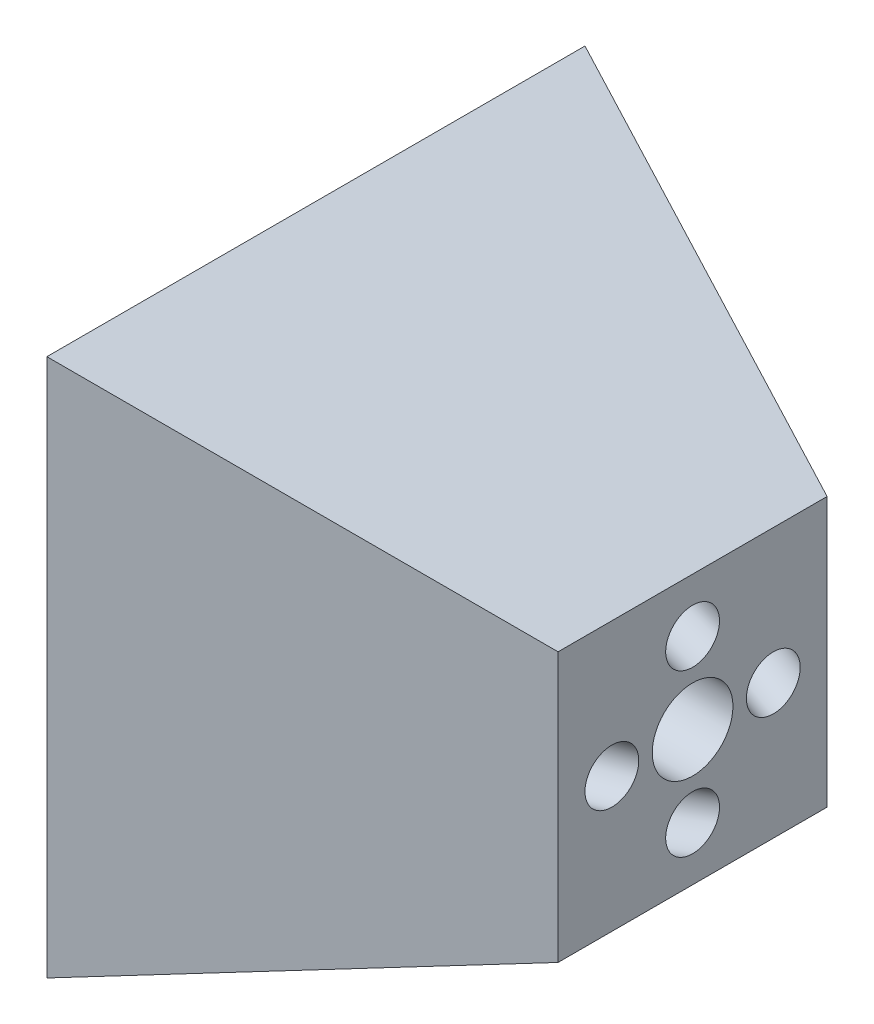
ISO-10303-21;
HEADER;
FILE_DESCRIPTION(('STEP AP214'),'2;1');
FILE_NAME('part.step','',(''),(''),'','','');
FILE_SCHEMA(('AUTOMOTIVE_DESIGN { 1 0 10303 214 1 1 1 1 }'));
ENDSEC;
DATA;
#1=APPLICATION_CONTEXT('core data for automotive mechanical design processes');
#2=APPLICATION_PROTOCOL_DEFINITION('international standard','automotive_design',2000,#1);
#3=PRODUCT_CONTEXT('',#1,'mechanical');
#4=PRODUCT('Part','Part','',(#3));
#5=PRODUCT_RELATED_PRODUCT_CATEGORY('part','',(#4));
#6=PRODUCT_DEFINITION_FORMATION('','',#4);
#7=PRODUCT_DEFINITION_CONTEXT('part definition',#1,'design');
#8=PRODUCT_DEFINITION('design','',#6,#7);
#9=PRODUCT_DEFINITION_SHAPE('','',#8);
#10=(LENGTH_UNIT() NAMED_UNIT(*) SI_UNIT(.MILLI.,.METRE.));
#11=(NAMED_UNIT(*) PLANE_ANGLE_UNIT() SI_UNIT($,.RADIAN.));
#12=(NAMED_UNIT(*) SI_UNIT($,.STERADIAN.) SOLID_ANGLE_UNIT());
#13=UNCERTAINTY_MEASURE_WITH_UNIT(LENGTH_MEASURE(1.E-05),#10,'distance_accuracy_value','');
#14=(GEOMETRIC_REPRESENTATION_CONTEXT(3) GLOBAL_UNCERTAINTY_ASSIGNED_CONTEXT((#13)) GLOBAL_UNIT_ASSIGNED_CONTEXT((#10,
#11,#12)) REPRESENTATION_CONTEXT('',''));
#15=CARTESIAN_POINT('',(0.,0.,0.));
#16=DIRECTION('',(0.,0.,1.));
#17=DIRECTION('',(1.,0.,0.));
#18=AXIS2_PLACEMENT_3D('',#15,#16,#17);
#19=CARTESIAN_POINT('',(-70.,0.,0.));
#20=DIRECTION('',(-1.,0.,0.));
#21=DIRECTION('',(0.,0.,1.));
#22=AXIS2_PLACEMENT_3D('',#19,#20,#21);
#23=PLANE('',#22);
#24=CARTESIAN_POINT('',(-70.,0.,0.));
#25=DIRECTION('',(-1.,0.,0.));
#26=DIRECTION('',(0.,0.,1.));
#27=AXIS2_PLACEMENT_3D('',#24,#25,#26);
#28=CIRCLE('',#27,7.5);
#29=CARTESIAN_POINT('',(-70.,0.,7.5));
#30=VERTEX_POINT('',#29);
#31=EDGE_CURVE('E257',#30,#30,#28,.T.);
#32=ORIENTED_EDGE('',*,*,#31,.F.);
#33=EDGE_LOOP('',(#32));
#34=FACE_BOUND('',#33,.T.);
#35=CARTESIAN_POINT('',(-70.,-40.,-5.));
#36=CARTESIAN_POINT('',(-70.,-40.1385285597722,-5.00000032981713));
#37=CARTESIAN_POINT('',(-70.,-40.2770598404374,-4.99423959397132));
#38=CARTESIAN_POINT('',(-70.,-40.5532169653213,-4.9712328197264));
#39=CARTESIAN_POINT('',(-70.,-40.690842445484,-4.95398241790151));
#40=CARTESIAN_POINT('',(-70.,-40.9641349848805,-4.9081192702556));
#41=CARTESIAN_POINT('',(-70.,-41.099802749291,-4.87951072719971));
#42=CARTESIAN_POINT('',(-70.,-41.368342982769,-4.81111653050569));
#43=CARTESIAN_POINT('',(-70.,-41.5012144289693,-4.77132686075552));
#44=CARTESIAN_POINT('',(-70.,-41.7631465157636,-4.68086588087655));
#45=CARTESIAN_POINT('',(-70.,-41.8922085079045,-4.63019848412395));
#46=CARTESIAN_POINT('',(-70.,-42.1457259013435,-4.51830334453991));
#47=CARTESIAN_POINT('',(-70.,-42.2701796325698,-4.45707181780892));
#48=CARTESIAN_POINT('',(-70.,-42.513527926577,-4.32450788011614));
#49=CARTESIAN_POINT('',(-70.,-42.6324244678463,-4.25317910101307));
#50=CARTESIAN_POINT('',(-70.,-42.8639267217283,-4.10086923517197));
#51=CARTESIAN_POINT('',(-70.,-42.9765301613516,-4.01988469356487));
#52=CARTESIAN_POINT('',(-70.,-43.1945828135308,-3.84887408108859));
#53=CARTESIAN_POINT('',(-70.,-43.3000345781974,-3.75885126432174));
#54=CARTESIAN_POINT('',(-70.,-43.5031365499259,-3.57032758490311));
#55=CARTESIAN_POINT('',(-70.,-43.6007839435785,-3.47182369123995));
#56=CARTESIAN_POINT('',(-70.,-43.7875267670873,-3.26708310772285));
#57=CARTESIAN_POINT('',(-70.,-43.8766252524076,-3.16084920470053));
#58=CARTESIAN_POINT('',(-70.,-44.0457251141884,-2.94131145127637));
#59=CARTESIAN_POINT('',(-70.,-44.1257232143997,-2.82800507729169));
#60=CARTESIAN_POINT('',(-70.,-44.2760055881049,-2.5951815442083));
#61=CARTESIAN_POINT('',(-70.,-44.3462933361537,-2.47566662782154));
#62=CARTESIAN_POINT('',(-70.,-44.4767270860926,-2.23116995645625));
#63=CARTESIAN_POINT('',(-70.,-44.5368694392566,-2.10618625492972));
#64=CARTESIAN_POINT('',(-70.,-44.6465463639701,-1.85170133664759));
#65=CARTESIAN_POINT('',(-70.,-44.6960847333377,-1.72220175664351));
#66=CARTESIAN_POINT('',(-70.,-44.7842548584076,-1.45948981041094));
#67=CARTESIAN_POINT('',(-70.,-44.8228826935603,-1.32627612841536));
#68=CARTESIAN_POINT('',(-70.,-44.8889290301765,-1.05714851815583));
#69=CARTESIAN_POINT('',(-70.,-44.9163515480349,-0.921235575754498));
#70=CARTESIAN_POINT('',(-70.,-44.9598265716953,-0.647555599702648));
#71=CARTESIAN_POINT('',(-70.,-44.9758749934918,-0.509787918160143));
#72=CARTESIAN_POINT('',(-70.,-44.9964676936532,-0.233435695490774));
#73=CARTESIAN_POINT('',(-70.,-45.0010160970825,-0.0948514651446628));
#74=CARTESIAN_POINT('',(-70.,-44.9986021457828,0.182230069313578));
#75=CARTESIAN_POINT('',(-70.,-44.9916356594831,0.32072732438062));
#76=CARTESIAN_POINT('',(-70.,-44.953482728418,0.734546474752408));
#77=CARTESIAN_POINT('',(-70.,-44.9050643005001,1.00848754755587));
#78=CARTESIAN_POINT('',(-70.,-44.7635758305878,1.5444319606773));
#79=CARTESIAN_POINT('',(-70.,-44.6705057885935,1.80643530099527));
#80=CARTESIAN_POINT('',(-70.,-44.4422819141459,2.31146468380315));
#81=CARTESIAN_POINT('',(-70.,-44.3071280816925,2.55449072629305));
#82=CARTESIAN_POINT('',(-70.,-43.9984641314033,3.0148124607998));
#83=CARTESIAN_POINT('',(-70.,-43.8249540135675,3.23210815281665));
#84=CARTESIAN_POINT('',(-70.,-43.4443631964797,3.63498929076985));
#85=CARTESIAN_POINT('',(-70.,-43.2372824972277,3.8205747367062));
#86=CARTESIAN_POINT('',(-70.,-42.7952620683577,4.15491308939109));
#87=CARTESIAN_POINT('',(-70.,-42.5603223387398,4.30366599613963));
#88=CARTESIAN_POINT('',(-70.,-42.0690638102171,4.56023742638518));
#89=CARTESIAN_POINT('',(-70.,-41.8127450113124,4.6680559498822));
#90=CARTESIAN_POINT('',(-70.,-41.285797963667,4.83978457424346));
#91=CARTESIAN_POINT('',(-70.,-41.0151697149264,4.90369467510771));
#92=CARTESIAN_POINT('',(-70.,-40.4670680625664,4.9858437959724));
#93=CARTESIAN_POINT('',(-70.,-40.189594658947,5.00408281597285));
#94=CARTESIAN_POINT('',(-70.,-39.6354557900676,4.99438669963854));
#95=CARTESIAN_POINT('',(-70.,-39.3587903248075,4.96645156330379));
#96=CARTESIAN_POINT('',(-70.,-38.8138981419513,4.8651776282638));
#97=CARTESIAN_POINT('',(-70.,-38.5456714243551,4.79183882955856));
#98=CARTESIAN_POINT('',(-70.,-38.025054793982,4.60178035212));
#99=CARTESIAN_POINT('',(-70.,-37.7726648812049,4.48506067338669));
#100=CARTESIAN_POINT('',(-70.,-37.2906831170471,4.21145972350985));
#101=CARTESIAN_POINT('',(-70.,-37.0610912656662,4.05457845236632));
#102=CARTESIAN_POINT('',(-70.,-36.63103807938,3.70498131609816));
#103=CARTESIAN_POINT('',(-70.,-36.4305767444746,3.51226545097352));
#104=CARTESIAN_POINT('',(-70.,-36.0643135870092,3.09631449206595));
#105=CARTESIAN_POINT('',(-70.,-35.8985117644491,2.87307939828303));
#106=CARTESIAN_POINT('',(-70.,-35.6061406711294,2.40224710911695));
#107=CARTESIAN_POINT('',(-70.,-35.4795714003697,2.15464991373378));
#108=CARTESIAN_POINT('',(-70.,-35.2691563630127,1.64192248831375));
#109=CARTESIAN_POINT('',(-70.,-35.1853105964155,1.37679225827689));
#110=CARTESIAN_POINT('',(-70.,-35.0626551475919,0.836311415287904));
#111=CARTESIAN_POINT('',(-70.,-35.0238454653656,0.560960802335789));
#112=CARTESIAN_POINT('',(-70.,-34.9923326086876,0.00763373772180405));
#113=CARTESIAN_POINT('',(-70.,-34.9996294342358,-0.270342713940066));
#114=CARTESIAN_POINT('',(-70.,-35.0601283380219,-0.821254489156064));
#115=CARTESIAN_POINT('',(-70.,-35.1133304162598,-1.09418981271019));
#116=CARTESIAN_POINT('',(-70.,-35.264172435097,-1.62749140013501));
#117=CARTESIAN_POINT('',(-70.,-35.3618123756963,-1.88785766400569));
#118=CARTESIAN_POINT('',(-70.,-35.5988370948303,-2.38883989431061));
#119=CARTESIAN_POINT('',(-70.,-35.7382218733651,-2.62945586074485));
#120=CARTESIAN_POINT('',(-70.,-36.0548917806495,-3.08430091602455));
#121=CARTESIAN_POINT('',(-70.,-36.2321769093991,-3.29853000487002));
#122=CARTESIAN_POINT('',(-70.,-36.6197579996372,-3.69469281836003));
#123=CARTESIAN_POINT('',(-70.,-36.8300539611259,-3.87662654300457));
#124=CARTESIAN_POINT('',(-70.,-37.2778555462234,-4.20317974343662));
#125=CARTESIAN_POINT('',(-70.,-37.5153611698324,-4.34779921922413));
#126=CARTESIAN_POINT('',(-70.,-38.0110347939087,-4.59573849952944));
#127=CARTESIAN_POINT('',(-70.,-38.2692027943761,-4.69905830404724));
#128=CARTESIAN_POINT('',(-70.,-38.7686106260893,-4.85219658129331));
#129=CARTESIAN_POINT('',(-70.,-39.0083845521352,-4.90680016248248));
#130=CARTESIAN_POINT('',(-70.,-39.3743108057609,-4.96227601702033));
#131=CARTESIAN_POINT('',(-70.,-39.4985855292943,-4.97636627846384));
#132=CARTESIAN_POINT('',(-70.,-39.7485699939562,-4.99525472988085));
#133=CARTESIAN_POINT('',(-70.,-39.8742838765479,-4.99999970068749));
#134=CARTESIAN_POINT('',(-70.,-40.,-5.));
#135=B_SPLINE_CURVE_WITH_KNOTS('',3,(#35,#36,#37,#38,#39,#40,#41,#42,#43,#44,#45,#46,#47,#48,
#49,#50,#51,#52,#53,#54,#55,#56,#57,#58,#59,#60,#61,#62,#63,#64,#65,#66,#67,#68,#69,#70,#71,#72,
#73,#74,#75,#76,#77,#78,#79,#80,#81,#82,#83,#84,#85,#86,#87,#88,#89,#90,#91,#92,#93,#94,#95,#96,
#97,#98,#99,#100,#101,#102,#103,#104,#105,#106,#107,#108,#109,#110,#111,#112,#113,#114,#115,
#116,#117,#118,#119,#120,#121,#122,#123,#124,#125,#126,#127,#128,#129,#130,#131,#132,#133,#134),
.UNSPECIFIED.,.T.,.F.,(4,2,2,2,2,2,2,2,2,2,2,2,2,2,2,2,2,2,2,2,2,2,2,2,2,2,2,2,2,2,2,2,2,2,2,2,
2,2,2,2,2,2,2,2,2,2,2,2,2,4),(0.,0.415470913561701,0.831099700376821,1.24657483840775,
1.66219940075635,2.07767468763347,2.49329910113597,2.90877439766643,3.32439880151561,
3.73987409870049,4.15549850189525,4.57097379912333,4.98659820227489,5.40207349950571,
5.81769790265452,6.23317319988551,6.64879760303415,7.06427290026514,7.47989730341377,
7.89537260064476,8.31099700379339,9.1413788156925,9.97176062759161,10.8021424394907,
11.6325242513898,12.4629060632889,13.293287875188,14.1236696870871,14.9540514989862,
15.7844333108853,16.6148151227845,17.4451969346836,18.2755787465827,19.1059605584818,
19.9363423703809,20.76672418228,21.5971059941791,22.4274878060782,23.2578696179773,
24.0882514298764,24.9186332417756,25.7490150536747,26.5793968655738,27.4097786774729,
28.240160489372,29.0705423012711,29.9009241131702,30.6358438530343,31.0107591240889,
31.3878033433168),.UNSPECIFIED.);
#136=CARTESIAN_POINT('',(-70.,-40.,-5.));
#137=VERTEX_POINT('',#136);
#138=EDGE_CURVE('E261',#137,#137,#135,.T.);
#139=ORIENTED_EDGE('',*,*,#138,.F.);
#140=EDGE_LOOP('',(#139));
#141=FACE_BOUND('',#140,.T.);
#142=CARTESIAN_POINT('',(-70.,0.,45.));
#143=CARTESIAN_POINT('',(-70.,0.138528559772201,45.0000003298171));
#144=CARTESIAN_POINT('',(-70.,0.277059840437411,44.9942395939713));
#145=CARTESIAN_POINT('',(-70.,0.553216965321283,44.9712328197264));
#146=CARTESIAN_POINT('',(-70.,0.69084244548403,44.9539824179015));
#147=CARTESIAN_POINT('',(-70.,0.964134984880491,44.9081192702556));
#148=CARTESIAN_POINT('',(-70.,1.09980274929103,44.8795107271997));
#149=CARTESIAN_POINT('',(-70.,1.36834298276903,44.8111165305057));
#150=CARTESIAN_POINT('',(-70.,1.50121442896931,44.7713268607555));
#151=CARTESIAN_POINT('',(-70.,1.76314651576362,44.6808658808765));
#152=CARTESIAN_POINT('',(-70.,1.89220850790452,44.6301984841239));
#153=CARTESIAN_POINT('',(-70.,2.14572590134348,44.5183033445399));
#154=CARTESIAN_POINT('',(-70.,2.27017963256982,44.4570718178089));
#155=CARTESIAN_POINT('',(-70.,2.51352792657698,44.3245078801161));
#156=CARTESIAN_POINT('',(-70.,2.63242446784624,44.253179101013));
#157=CARTESIAN_POINT('',(-70.,2.8639267217283,44.1008692351719));
#158=CARTESIAN_POINT('',(-70.,2.97653016135155,44.0198846935648));
#159=CARTESIAN_POINT('',(-70.,3.19458281353074,43.8488740810886));
#160=CARTESIAN_POINT('',(-70.,3.3000345781974,43.7588512643217));
#161=CARTESIAN_POINT('',(-70.,3.50313654992584,43.5703275849031));
#162=CARTESIAN_POINT('',(-70.,3.60078394357853,43.4718236912399));
#163=CARTESIAN_POINT('',(-70.,3.78752676708732,43.2670831077228));
#164=CARTESIAN_POINT('',(-70.,3.87662525240761,43.1608492047005));
#165=CARTESIAN_POINT('',(-70.,4.04572511418836,42.9413114512763));
#166=CARTESIAN_POINT('',(-70.,4.12572321439969,42.8280050772917));
#167=CARTESIAN_POINT('',(-70.,4.27600558810492,42.5951815442083));
#168=CARTESIAN_POINT('',(-70.,4.34629333615374,42.4756666278215));
#169=CARTESIAN_POINT('',(-70.,4.47672708609261,42.2311699564562));
#170=CARTESIAN_POINT('',(-70.,4.53686943925658,42.1061862549297));
#171=CARTESIAN_POINT('',(-70.,4.64654636397007,41.8517013366476));
#172=CARTESIAN_POINT('',(-70.,4.69608473333768,41.7222017566435));
#173=CARTESIAN_POINT('',(-70.,4.78425485840758,41.4594898104109));
#174=CARTESIAN_POINT('',(-70.,4.8228826935603,41.3262761284153));
#175=CARTESIAN_POINT('',(-70.,4.88892903017653,41.0571485181558));
#176=CARTESIAN_POINT('',(-70.,4.91635154803486,40.9212355757545));
#177=CARTESIAN_POINT('',(-70.,4.95982657169533,40.6475555997026));
#178=CARTESIAN_POINT('',(-70.,4.97587499349174,40.5097879181601));
#179=CARTESIAN_POINT('',(-70.,4.99646769365314,40.2334356954907));
#180=CARTESIAN_POINT('',(-70.,5.00101609708246,40.0948514651446));
#181=CARTESIAN_POINT('',(-70.,4.99860214578275,39.8177699306864));
#182=CARTESIAN_POINT('',(-70.,4.99163565948307,39.6792726756194));
#183=CARTESIAN_POINT('',(-70.,4.953482728418,39.2654535252476));
#184=CARTESIAN_POINT('',(-70.,4.90506430050006,38.9915124524441));
#185=CARTESIAN_POINT('',(-70.,4.76357583058781,38.4555680393227));
#186=CARTESIAN_POINT('',(-70.,4.6705057885935,38.1935646990047));
#187=CARTESIAN_POINT('',(-70.,4.44228191414584,37.6885353161968));
#188=CARTESIAN_POINT('',(-70.,4.30712808169249,37.4455092737069));
#189=CARTESIAN_POINT('',(-70.,3.99846413140332,36.9851875392002));
#190=CARTESIAN_POINT('',(-70.,3.8249540135675,36.7678918471833));
#191=CARTESIAN_POINT('',(-70.,3.44436319647969,36.3650107092301));
#192=CARTESIAN_POINT('',(-70.,3.2372824972277,36.1794252632938));
#193=CARTESIAN_POINT('',(-70.,2.79526206835773,35.8450869106089));
#194=CARTESIAN_POINT('',(-70.,2.56032233873975,35.6963340038603));
#195=CARTESIAN_POINT('',(-70.,2.06906381021707,35.4397625736148));
#196=CARTESIAN_POINT('',(-70.,1.81274501131237,35.3319440501178));
#197=CARTESIAN_POINT('',(-70.,1.28579796366704,35.1602154257565));
#198=CARTESIAN_POINT('',(-70.,1.01516971492641,35.0963053248923));
#199=CARTESIAN_POINT('',(-70.,0.467068062566414,35.0141562040276));
#200=CARTESIAN_POINT('',(-70.,0.189594658947039,34.9959171840271));
#201=CARTESIAN_POINT('',(-70.,-0.364544209932404,35.0056133003614));
#202=CARTESIAN_POINT('',(-70.,-0.64120967519247,35.0335484366962));
#203=CARTESIAN_POINT('',(-70.,-1.1861018580487,35.1348223717362));
#204=CARTESIAN_POINT('',(-70.,-1.45432857564486,35.2081611704414));
#205=CARTESIAN_POINT('',(-70.,-1.97494520601803,35.39821964788));
#206=CARTESIAN_POINT('',(-70.,-2.22733511879504,35.5149393266133));
#207=CARTESIAN_POINT('',(-70.,-2.70931688295291,35.7885402764901));
#208=CARTESIAN_POINT('',(-70.,-2.93890873433377,35.9454215476336));
#209=CARTESIAN_POINT('',(-70.,-3.36896192062001,36.2950186839018));
#210=CARTESIAN_POINT('',(-70.,-3.5694232555254,36.4877345490264));
#211=CARTESIAN_POINT('',(-70.,-3.93568641299084,36.903685507934));
#212=CARTESIAN_POINT('',(-70.,-4.10148823555089,37.1269206017169));
#213=CARTESIAN_POINT('',(-70.,-4.39385932887062,37.597752890883));
#214=CARTESIAN_POINT('',(-70.,-4.52042859963029,37.8453500862662));
#215=CARTESIAN_POINT('',(-70.,-4.73084363698725,38.3580775116862));
#216=CARTESIAN_POINT('',(-70.,-4.81468940358453,38.623207741723));
#217=CARTESIAN_POINT('',(-70.,-4.93734485240809,39.163688584712));
#218=CARTESIAN_POINT('',(-70.,-4.97615453463437,39.4390391976641));
#219=CARTESIAN_POINT('',(-70.,-5.00766739131245,39.9923662622781));
#220=CARTESIAN_POINT('',(-70.,-5.00037056576426,40.27034271394));
#221=CARTESIAN_POINT('',(-70.,-4.93987166197812,40.821254489156));
#222=CARTESIAN_POINT('',(-70.,-4.88666958374018,41.0941898127101));
#223=CARTESIAN_POINT('',(-70.,-4.735827564903,41.6274914001349));
#224=CARTESIAN_POINT('',(-70.,-4.63818762430376,41.8878576640056));
#225=CARTESIAN_POINT('',(-70.,-4.40116290516972,42.3888398943105));
#226=CARTESIAN_POINT('',(-70.,-4.26177812663493,42.6294558607447));
#227=CARTESIAN_POINT('',(-70.,-3.94510821935057,43.0843009160244));
#228=CARTESIAN_POINT('',(-70.,-3.76782309060101,43.2985300048699));
#229=CARTESIAN_POINT('',(-70.,-3.38024200036284,43.6946928183599));
#230=CARTESIAN_POINT('',(-70.,-3.16994603887423,43.8766265430045));
#231=CARTESIAN_POINT('',(-70.,-2.72214445377666,44.2031797434365));
#232=CARTESIAN_POINT('',(-70.,-2.48463883016771,44.3477992192241));
#233=CARTESIAN_POINT('',(-70.,-1.98896520609138,44.5957384995294));
#234=CARTESIAN_POINT('',(-70.,-1.73079720562401,44.6990583040472));
#235=CARTESIAN_POINT('',(-70.,-1.23138937391075,44.8521965812932));
#236=CARTESIAN_POINT('',(-70.,-0.991615447864825,44.9068001624824));
#237=CARTESIAN_POINT('',(-70.,-0.625689194239192,44.9622760170203));
#238=CARTESIAN_POINT('',(-70.,-0.501414470705703,44.9763662784638));
#239=CARTESIAN_POINT('',(-70.,-0.251430006043863,44.9952547298808));
#240=CARTESIAN_POINT('',(-70.,-0.125716123452096,44.9999997006875));
#241=CARTESIAN_POINT('',(-70.,0.,45.));
#242=B_SPLINE_CURVE_WITH_KNOTS('',3,(#142,#143,#144,#145,#146,#147,#148,#149,#150,#151,#152,
#153,#154,#155,#156,#157,#158,#159,#160,#161,#162,#163,#164,#165,#166,#167,#168,#169,#170,#171,
#172,#173,#174,#175,#176,#177,#178,#179,#180,#181,#182,#183,#184,#185,#186,#187,#188,#189,#190,
#191,#192,#193,#194,#195,#196,#197,#198,#199,#200,#201,#202,#203,#204,#205,#206,#207,#208,#209,
#210,#211,#212,#213,#214,#215,#216,#217,#218,#219,#220,#221,#222,#223,#224,#225,#226,#227,#228,
#229,#230,#231,#232,#233,#234,#235,#236,#237,#238,#239,#240,#241),.UNSPECIFIED.,.T.,.F.,(4,2,2,
2,2,2,2,2,2,2,2,2,2,2,2,2,2,2,2,2,2,2,2,2,2,2,2,2,2,2,2,2,2,2,2,2,2,2,2,2,2,2,2,2,2,2,2,2,2,4),
(0.,0.415470913561703,0.831099700376822,1.24657483840776,1.66219940075635,2.07767468763348,
2.49329910113597,2.90877439766642,3.32439880151561,3.73987409870048,4.15549850189525,
4.57097379912333,4.98659820227489,5.40207349950572,5.81769790265452,6.2331731998855,
6.64879760303415,7.06427290026514,7.47989730341376,7.89537260064475,8.31099700379338,
9.14137881569249,9.97176062759159,10.8021424394907,11.6325242513898,12.4629060632889,
13.293287875188,14.1236696870871,14.9540514989862,15.7844333108853,16.6148151227844,
17.4451969346835,18.2755787465826,19.1059605584818,19.9363423703809,20.76672418228,
21.5971059941791,22.4274878060782,23.2578696179773,24.0882514298764,24.9186332417755,
25.7490150536746,26.5793968655737,27.4097786774728,28.2401604893719,29.070542301271,
29.9009241131701,30.6358438530342,31.0107591240888,31.3878033433167),.UNSPECIFIED.);
#243=CARTESIAN_POINT('',(-70.,0.,45.));
#244=VERTEX_POINT('',#243);
#245=EDGE_CURVE('E265',#244,#244,#242,.T.);
#246=ORIENTED_EDGE('',*,*,#245,.F.);
#247=EDGE_LOOP('',(#246));
#248=FACE_BOUND('',#247,.T.);
#249=CARTESIAN_POINT('',(-70.,40.,-5.));
#250=CARTESIAN_POINT('',(-70.,40.1385285597722,-5.00000032981713));
#251=CARTESIAN_POINT('',(-70.,40.2770598404374,-4.99423959397132));
#252=CARTESIAN_POINT('',(-70.,40.5532169653213,-4.9712328197264));
#253=CARTESIAN_POINT('',(-70.,40.690842445484,-4.95398241790151));
#254=CARTESIAN_POINT('',(-70.,40.9641349848805,-4.9081192702556));
#255=CARTESIAN_POINT('',(-70.,41.099802749291,-4.87951072719971));
#256=CARTESIAN_POINT('',(-70.,41.368342982769,-4.81111653050569));
#257=CARTESIAN_POINT('',(-70.,41.5012144289693,-4.77132686075552));
#258=CARTESIAN_POINT('',(-70.,41.7631465157636,-4.68086588087655));
#259=CARTESIAN_POINT('',(-70.,41.8922085079045,-4.63019848412395));
#260=CARTESIAN_POINT('',(-70.,42.1457259013435,-4.51830334453991));
#261=CARTESIAN_POINT('',(-70.,42.2701796325698,-4.45707181780892));
#262=CARTESIAN_POINT('',(-70.,42.513527926577,-4.32450788011614));
#263=CARTESIAN_POINT('',(-70.,42.6324244678463,-4.25317910101307));
#264=CARTESIAN_POINT('',(-70.,42.8639267217283,-4.10086923517197));
#265=CARTESIAN_POINT('',(-70.,42.9765301613516,-4.01988469356487));
#266=CARTESIAN_POINT('',(-70.,43.1945828135308,-3.84887408108859));
#267=CARTESIAN_POINT('',(-70.,43.3000345781974,-3.75885126432174));
#268=CARTESIAN_POINT('',(-70.,43.5031365499259,-3.57032758490311));
#269=CARTESIAN_POINT('',(-70.,43.6007839435785,-3.47182369123995));
#270=CARTESIAN_POINT('',(-70.,43.7875267670873,-3.26708310772285));
#271=CARTESIAN_POINT('',(-70.,43.8766252524076,-3.16084920470053));
#272=CARTESIAN_POINT('',(-70.,44.0457251141884,-2.94131145127637));
#273=CARTESIAN_POINT('',(-70.,44.1257232143997,-2.82800507729169));
#274=CARTESIAN_POINT('',(-70.,44.2760055881049,-2.5951815442083));
#275=CARTESIAN_POINT('',(-70.,44.3462933361537,-2.47566662782154));
#276=CARTESIAN_POINT('',(-70.,44.4767270860926,-2.23116995645625));
#277=CARTESIAN_POINT('',(-70.,44.5368694392566,-2.10618625492972));
#278=CARTESIAN_POINT('',(-70.,44.6465463639701,-1.85170133664759));
#279=CARTESIAN_POINT('',(-70.,44.6960847333377,-1.72220175664351));
#280=CARTESIAN_POINT('',(-70.,44.7842548584076,-1.45948981041094));
#281=CARTESIAN_POINT('',(-70.,44.8228826935603,-1.32627612841536));
#282=CARTESIAN_POINT('',(-70.,44.8889290301765,-1.05714851815583));
#283=CARTESIAN_POINT('',(-70.,44.9163515480349,-0.921235575754498));
#284=CARTESIAN_POINT('',(-70.,44.9598265716953,-0.647555599702648));
#285=CARTESIAN_POINT('',(-70.,44.9758749934918,-0.509787918160143));
#286=CARTESIAN_POINT('',(-70.,44.9964676936532,-0.233435695490774));
#287=CARTESIAN_POINT('',(-70.,45.0010160970825,-0.0948514651446628));
#288=CARTESIAN_POINT('',(-70.,44.9986021457828,0.182230069313578));
#289=CARTESIAN_POINT('',(-70.,44.9916356594831,0.32072732438062));
#290=CARTESIAN_POINT('',(-70.,44.953482728418,0.734546474752408));
#291=CARTESIAN_POINT('',(-70.,44.9050643005001,1.00848754755587));
#292=CARTESIAN_POINT('',(-70.,44.7635758305878,1.5444319606773));
#293=CARTESIAN_POINT('',(-70.,44.6705057885935,1.80643530099527));
#294=CARTESIAN_POINT('',(-70.,44.4422819141459,2.31146468380315));
#295=CARTESIAN_POINT('',(-70.,44.3071280816925,2.55449072629305));
#296=CARTESIAN_POINT('',(-70.,43.9984641314033,3.0148124607998));
#297=CARTESIAN_POINT('',(-70.,43.8249540135675,3.23210815281665));
#298=CARTESIAN_POINT('',(-70.,43.4443631964797,3.63498929076985));
#299=CARTESIAN_POINT('',(-70.,43.2372824972277,3.8205747367062));
#300=CARTESIAN_POINT('',(-70.,42.7952620683577,4.15491308939109));
#301=CARTESIAN_POINT('',(-70.,42.5603223387398,4.30366599613963));
#302=CARTESIAN_POINT('',(-70.,42.0690638102171,4.56023742638518));
#303=CARTESIAN_POINT('',(-70.,41.8127450113124,4.6680559498822));
#304=CARTESIAN_POINT('',(-70.,41.285797963667,4.83978457424346));
#305=CARTESIAN_POINT('',(-70.,41.0151697149264,4.90369467510771));
#306=CARTESIAN_POINT('',(-70.,40.4670680625664,4.9858437959724));
#307=CARTESIAN_POINT('',(-70.,40.189594658947,5.00408281597285));
#308=CARTESIAN_POINT('',(-70.,39.6354557900676,4.99438669963854));
#309=CARTESIAN_POINT('',(-70.,39.3587903248075,4.96645156330379));
#310=CARTESIAN_POINT('',(-70.,38.8138981419513,4.8651776282638));
#311=CARTESIAN_POINT('',(-70.,38.5456714243551,4.79183882955856));
#312=CARTESIAN_POINT('',(-70.,38.025054793982,4.60178035212));
#313=CARTESIAN_POINT('',(-70.,37.7726648812049,4.48506067338669));
#314=CARTESIAN_POINT('',(-70.,37.2906831170471,4.21145972350985));
#315=CARTESIAN_POINT('',(-70.,37.0610912656662,4.05457845236632));
#316=CARTESIAN_POINT('',(-70.,36.63103807938,3.70498131609816));
#317=CARTESIAN_POINT('',(-70.,36.4305767444746,3.51226545097352));
#318=CARTESIAN_POINT('',(-70.,36.0643135870092,3.09631449206595));
#319=CARTESIAN_POINT('',(-70.,35.8985117644491,2.87307939828303));
#320=CARTESIAN_POINT('',(-70.,35.6061406711294,2.40224710911695));
#321=CARTESIAN_POINT('',(-70.,35.4795714003697,2.15464991373378));
#322=CARTESIAN_POINT('',(-70.,35.2691563630127,1.64192248831375));
#323=CARTESIAN_POINT('',(-70.,35.1853105964155,1.37679225827689));
#324=CARTESIAN_POINT('',(-70.,35.0626551475919,0.836311415287904));
#325=CARTESIAN_POINT('',(-70.,35.0238454653656,0.560960802335789));
#326=CARTESIAN_POINT('',(-70.,34.9923326086876,0.00763373772180405));
#327=CARTESIAN_POINT('',(-70.,34.9996294342358,-0.270342713940066));
#328=CARTESIAN_POINT('',(-70.,35.0601283380219,-0.821254489156064));
#329=CARTESIAN_POINT('',(-70.,35.1133304162598,-1.09418981271019));
#330=CARTESIAN_POINT('',(-70.,35.264172435097,-1.62749140013501));
#331=CARTESIAN_POINT('',(-70.,35.3618123756963,-1.88785766400569));
#332=CARTESIAN_POINT('',(-70.,35.5988370948303,-2.38883989431061));
#333=CARTESIAN_POINT('',(-70.,35.7382218733651,-2.62945586074485));
#334=CARTESIAN_POINT('',(-70.,36.0548917806495,-3.08430091602455));
#335=CARTESIAN_POINT('',(-70.,36.2321769093991,-3.29853000487002));
#336=CARTESIAN_POINT('',(-70.,36.6197579996372,-3.69469281836003));
#337=CARTESIAN_POINT('',(-70.,36.8300539611259,-3.87662654300457));
#338=CARTESIAN_POINT('',(-70.,37.2778555462234,-4.20317974343662));
#339=CARTESIAN_POINT('',(-70.,37.5153611698324,-4.34779921922413));
#340=CARTESIAN_POINT('',(-70.,38.0110347939087,-4.59573849952944));
#341=CARTESIAN_POINT('',(-70.,38.2692027943761,-4.69905830404724));
#342=CARTESIAN_POINT('',(-70.,38.7686106260893,-4.85219658129331));
#343=CARTESIAN_POINT('',(-70.,39.0083845521352,-4.90680016248248));
#344=CARTESIAN_POINT('',(-70.,39.3743108057609,-4.96227601702033));
#345=CARTESIAN_POINT('',(-70.,39.4985855292943,-4.97636627846384));
#346=CARTESIAN_POINT('',(-70.,39.7485699939562,-4.99525472988085));
#347=CARTESIAN_POINT('',(-70.,39.8742838765479,-4.99999970068749));
#348=CARTESIAN_POINT('',(-70.,40.,-5.));
#349=B_SPLINE_CURVE_WITH_KNOTS('',3,(#249,#250,#251,#252,#253,#254,#255,#256,#257,#258,#259,
#260,#261,#262,#263,#264,#265,#266,#267,#268,#269,#270,#271,#272,#273,#274,#275,#276,#277,#278,
#279,#280,#281,#282,#283,#284,#285,#286,#287,#288,#289,#290,#291,#292,#293,#294,#295,#296,#297,
#298,#299,#300,#301,#302,#303,#304,#305,#306,#307,#308,#309,#310,#311,#312,#313,#314,#315,#316,
#317,#318,#319,#320,#321,#322,#323,#324,#325,#326,#327,#328,#329,#330,#331,#332,#333,#334,#335,
#336,#337,#338,#339,#340,#341,#342,#343,#344,#345,#346,#347,#348),.UNSPECIFIED.,.T.,.F.,(4,2,2,
2,2,2,2,2,2,2,2,2,2,2,2,2,2,2,2,2,2,2,2,2,2,2,2,2,2,2,2,2,2,2,2,2,2,2,2,2,2,2,2,2,2,2,2,2,2,4),
(0.,0.415470913561701,0.831099700376821,1.24657483840775,1.66219940075635,2.07767468763347,
2.49329910113597,2.90877439766643,3.32439880151561,3.73987409870049,4.15549850189525,
4.57097379912333,4.98659820227489,5.40207349950571,5.81769790265452,6.23317319988551,
6.64879760303415,7.06427290026514,7.47989730341377,7.89537260064476,8.31099700379339,
9.1413788156925,9.97176062759161,10.8021424394907,11.6325242513898,12.4629060632889,
13.293287875188,14.1236696870871,14.9540514989862,15.7844333108853,16.6148151227845,
17.4451969346836,18.2755787465827,19.1059605584818,19.9363423703809,20.76672418228,
21.5971059941791,22.4274878060782,23.2578696179773,24.0882514298764,24.9186332417756,
25.7490150536747,26.5793968655738,27.4097786774729,28.240160489372,29.0705423012711,
29.9009241131702,30.6358438530343,31.0107591240889,31.3878033433168),.UNSPECIFIED.);
#350=CARTESIAN_POINT('',(-70.,40.,-5.));
#351=VERTEX_POINT('',#350);
#352=EDGE_CURVE('E269',#351,#351,#349,.T.);
#353=ORIENTED_EDGE('',*,*,#352,.T.);
#354=EDGE_LOOP('',(#353));
#355=FACE_BOUND('',#354,.T.);
#356=CARTESIAN_POINT('',(-70.,0.,-45.));
#357=CARTESIAN_POINT('',(-70.,0.138528559772201,-45.0000003298171));
#358=CARTESIAN_POINT('',(-70.,0.277059840437411,-44.9942395939713));
#359=CARTESIAN_POINT('',(-70.,0.553216965321283,-44.9712328197264));
#360=CARTESIAN_POINT('',(-70.,0.69084244548403,-44.9539824179015));
#361=CARTESIAN_POINT('',(-70.,0.964134984880491,-44.9081192702556));
#362=CARTESIAN_POINT('',(-70.,1.09980274929103,-44.8795107271997));
#363=CARTESIAN_POINT('',(-70.,1.36834298276903,-44.8111165305057));
#364=CARTESIAN_POINT('',(-70.,1.50121442896931,-44.7713268607555));
#365=CARTESIAN_POINT('',(-70.,1.76314651576362,-44.6808658808765));
#366=CARTESIAN_POINT('',(-70.,1.89220850790452,-44.6301984841239));
#367=CARTESIAN_POINT('',(-70.,2.14572590134348,-44.5183033445399));
#368=CARTESIAN_POINT('',(-70.,2.27017963256982,-44.4570718178089));
#369=CARTESIAN_POINT('',(-70.,2.51352792657698,-44.3245078801161));
#370=CARTESIAN_POINT('',(-70.,2.63242446784624,-44.253179101013));
#371=CARTESIAN_POINT('',(-70.,2.8639267217283,-44.1008692351719));
#372=CARTESIAN_POINT('',(-70.,2.97653016135155,-44.0198846935648));
#373=CARTESIAN_POINT('',(-70.,3.19458281353074,-43.8488740810886));
#374=CARTESIAN_POINT('',(-70.,3.3000345781974,-43.7588512643217));
#375=CARTESIAN_POINT('',(-70.,3.50313654992584,-43.5703275849031));
#376=CARTESIAN_POINT('',(-70.,3.60078394357853,-43.4718236912399));
#377=CARTESIAN_POINT('',(-70.,3.78752676708732,-43.2670831077228));
#378=CARTESIAN_POINT('',(-70.,3.87662525240761,-43.1608492047005));
#379=CARTESIAN_POINT('',(-70.,4.04572511418836,-42.9413114512763));
#380=CARTESIAN_POINT('',(-70.,4.12572321439969,-42.8280050772917));
#381=CARTESIAN_POINT('',(-70.,4.27600558810492,-42.5951815442083));
#382=CARTESIAN_POINT('',(-70.,4.34629333615374,-42.4756666278215));
#383=CARTESIAN_POINT('',(-70.,4.47672708609261,-42.2311699564562));
#384=CARTESIAN_POINT('',(-70.,4.53686943925658,-42.1061862549297));
#385=CARTESIAN_POINT('',(-70.,4.64654636397007,-41.8517013366476));
#386=CARTESIAN_POINT('',(-70.,4.69608473333768,-41.7222017566435));
#387=CARTESIAN_POINT('',(-70.,4.78425485840758,-41.4594898104109));
#388=CARTESIAN_POINT('',(-70.,4.8228826935603,-41.3262761284153));
#389=CARTESIAN_POINT('',(-70.,4.88892903017653,-41.0571485181558));
#390=CARTESIAN_POINT('',(-70.,4.91635154803486,-40.9212355757545));
#391=CARTESIAN_POINT('',(-70.,4.95982657169533,-40.6475555997026));
#392=CARTESIAN_POINT('',(-70.,4.97587499349174,-40.5097879181601));
#393=CARTESIAN_POINT('',(-70.,4.99646769365314,-40.2334356954907));
#394=CARTESIAN_POINT('',(-70.,5.00101609708246,-40.0948514651446));
#395=CARTESIAN_POINT('',(-70.,4.99860214578275,-39.8177699306864));
#396=CARTESIAN_POINT('',(-70.,4.99163565948307,-39.6792726756194));
#397=CARTESIAN_POINT('',(-70.,4.953482728418,-39.2654535252476));
#398=CARTESIAN_POINT('',(-70.,4.90506430050006,-38.9915124524441));
#399=CARTESIAN_POINT('',(-70.,4.76357583058781,-38.4555680393227));
#400=CARTESIAN_POINT('',(-70.,4.6705057885935,-38.1935646990047));
#401=CARTESIAN_POINT('',(-70.,4.44228191414584,-37.6885353161968));
#402=CARTESIAN_POINT('',(-70.,4.30712808169249,-37.4455092737069));
#403=CARTESIAN_POINT('',(-70.,3.99846413140332,-36.9851875392002));
#404=CARTESIAN_POINT('',(-70.,3.8249540135675,-36.7678918471833));
#405=CARTESIAN_POINT('',(-70.,3.44436319647969,-36.3650107092301));
#406=CARTESIAN_POINT('',(-70.,3.2372824972277,-36.1794252632938));
#407=CARTESIAN_POINT('',(-70.,2.79526206835773,-35.8450869106089));
#408=CARTESIAN_POINT('',(-70.,2.56032233873975,-35.6963340038603));
#409=CARTESIAN_POINT('',(-70.,2.06906381021707,-35.4397625736148));
#410=CARTESIAN_POINT('',(-70.,1.81274501131237,-35.3319440501178));
#411=CARTESIAN_POINT('',(-70.,1.28579796366704,-35.1602154257565));
#412=CARTESIAN_POINT('',(-70.,1.01516971492641,-35.0963053248923));
#413=CARTESIAN_POINT('',(-70.,0.467068062566414,-35.0141562040276));
#414=CARTESIAN_POINT('',(-70.,0.189594658947039,-34.9959171840271));
#415=CARTESIAN_POINT('',(-70.,-0.364544209932404,-35.0056133003614));
#416=CARTESIAN_POINT('',(-70.,-0.64120967519247,-35.0335484366962));
#417=CARTESIAN_POINT('',(-70.,-1.1861018580487,-35.1348223717362));
#418=CARTESIAN_POINT('',(-70.,-1.45432857564486,-35.2081611704414));
#419=CARTESIAN_POINT('',(-70.,-1.97494520601803,-35.39821964788));
#420=CARTESIAN_POINT('',(-70.,-2.22733511879504,-35.5149393266133));
#421=CARTESIAN_POINT('',(-70.,-2.70931688295291,-35.7885402764901));
#422=CARTESIAN_POINT('',(-70.,-2.93890873433377,-35.9454215476336));
#423=CARTESIAN_POINT('',(-70.,-3.36896192062001,-36.2950186839018));
#424=CARTESIAN_POINT('',(-70.,-3.5694232555254,-36.4877345490264));
#425=CARTESIAN_POINT('',(-70.,-3.93568641299084,-36.903685507934));
#426=CARTESIAN_POINT('',(-70.,-4.10148823555089,-37.1269206017169));
#427=CARTESIAN_POINT('',(-70.,-4.39385932887062,-37.597752890883));
#428=CARTESIAN_POINT('',(-70.,-4.52042859963029,-37.8453500862662));
#429=CARTESIAN_POINT('',(-70.,-4.73084363698725,-38.3580775116862));
#430=CARTESIAN_POINT('',(-70.,-4.81468940358453,-38.623207741723));
#431=CARTESIAN_POINT('',(-70.,-4.93734485240809,-39.163688584712));
#432=CARTESIAN_POINT('',(-70.,-4.97615453463437,-39.4390391976641));
#433=CARTESIAN_POINT('',(-70.,-5.00766739131245,-39.9923662622781));
#434=CARTESIAN_POINT('',(-70.,-5.00037056576426,-40.27034271394));
#435=CARTESIAN_POINT('',(-70.,-4.93987166197812,-40.821254489156));
#436=CARTESIAN_POINT('',(-70.,-4.88666958374018,-41.0941898127101));
#437=CARTESIAN_POINT('',(-70.,-4.735827564903,-41.6274914001349));
#438=CARTESIAN_POINT('',(-70.,-4.63818762430376,-41.8878576640056));
#439=CARTESIAN_POINT('',(-70.,-4.40116290516972,-42.3888398943105));
#440=CARTESIAN_POINT('',(-70.,-4.26177812663493,-42.6294558607447));
#441=CARTESIAN_POINT('',(-70.,-3.94510821935057,-43.0843009160244));
#442=CARTESIAN_POINT('',(-70.,-3.76782309060101,-43.2985300048699));
#443=CARTESIAN_POINT('',(-70.,-3.38024200036284,-43.6946928183599));
#444=CARTESIAN_POINT('',(-70.,-3.16994603887423,-43.8766265430045));
#445=CARTESIAN_POINT('',(-70.,-2.72214445377666,-44.2031797434365));
#446=CARTESIAN_POINT('',(-70.,-2.48463883016771,-44.3477992192241));
#447=CARTESIAN_POINT('',(-70.,-1.98896520609138,-44.5957384995294));
#448=CARTESIAN_POINT('',(-70.,-1.73079720562401,-44.6990583040472));
#449=CARTESIAN_POINT('',(-70.,-1.23138937391075,-44.8521965812932));
#450=CARTESIAN_POINT('',(-70.,-0.991615447864825,-44.9068001624824));
#451=CARTESIAN_POINT('',(-70.,-0.625689194239192,-44.9622760170203));
#452=CARTESIAN_POINT('',(-70.,-0.501414470705703,-44.9763662784638));
#453=CARTESIAN_POINT('',(-70.,-0.251430006043863,-44.9952547298808));
#454=CARTESIAN_POINT('',(-70.,-0.125716123452096,-44.9999997006875));
#455=CARTESIAN_POINT('',(-70.,0.,-45.));
#456=B_SPLINE_CURVE_WITH_KNOTS('',3,(#356,#357,#358,#359,#360,#361,#362,#363,#364,#365,#366,
#367,#368,#369,#370,#371,#372,#373,#374,#375,#376,#377,#378,#379,#380,#381,#382,#383,#384,#385,
#386,#387,#388,#389,#390,#391,#392,#393,#394,#395,#396,#397,#398,#399,#400,#401,#402,#403,#404,
#405,#406,#407,#408,#409,#410,#411,#412,#413,#414,#415,#416,#417,#418,#419,#420,#421,#422,#423,
#424,#425,#426,#427,#428,#429,#430,#431,#432,#433,#434,#435,#436,#437,#438,#439,#440,#441,#442,
#443,#444,#445,#446,#447,#448,#449,#450,#451,#452,#453,#454,#455),.UNSPECIFIED.,.T.,.F.,(4,2,2,
2,2,2,2,2,2,2,2,2,2,2,2,2,2,2,2,2,2,2,2,2,2,2,2,2,2,2,2,2,2,2,2,2,2,2,2,2,2,2,2,2,2,2,2,2,2,4),
(0.,0.415470913561703,0.831099700376822,1.24657483840776,1.66219940075635,2.07767468763348,
2.49329910113597,2.90877439766642,3.32439880151561,3.73987409870048,4.15549850189525,
4.57097379912333,4.98659820227489,5.40207349950572,5.81769790265452,6.2331731998855,
6.64879760303415,7.06427290026514,7.47989730341376,7.89537260064475,8.31099700379338,
9.14137881569249,9.97176062759159,10.8021424394907,11.6325242513898,12.4629060632889,
13.293287875188,14.1236696870871,14.9540514989862,15.7844333108853,16.6148151227844,
17.4451969346835,18.2755787465826,19.1059605584818,19.9363423703809,20.76672418228,
21.5971059941791,22.4274878060782,23.2578696179773,24.0882514298764,24.9186332417755,
25.7490150536746,26.5793968655737,27.4097786774728,28.2401604893719,29.070542301271,
29.9009241131701,30.6358438530342,31.0107591240888,31.3878033433167),.UNSPECIFIED.);
#457=CARTESIAN_POINT('',(-70.,0.,-45.));
#458=VERTEX_POINT('',#457);
#459=EDGE_CURVE('E113',#458,#458,#456,.T.);
#460=ORIENTED_EDGE('',*,*,#459,.T.);
#461=EDGE_LOOP('',(#460));
#462=FACE_BOUND('',#461,.T.);
#463=DIRECTION('',(0.,-1.,0.));
#464=VECTOR('',#463,1.);
#465=CARTESIAN_POINT('',(-70.,50.,50.));
#466=LINE('',#465,#464);
#467=CARTESIAN_POINT('',(-70.,50.,50.));
#468=VERTEX_POINT('',#467);
#469=CARTESIAN_POINT('',(-70.,-50.,50.));
#470=VERTEX_POINT('',#469);
#471=EDGE_CURVE('E93',#468,#470,#466,.T.);
#472=ORIENTED_EDGE('',*,*,#471,.F.);
#473=DIRECTION('',(0.,0.,1.));
#474=VECTOR('',#473,1.);
#475=CARTESIAN_POINT('',(-70.,50.,-50.));
#476=LINE('',#475,#474);
#477=CARTESIAN_POINT('',(-70.,50.,-50.));
#478=VERTEX_POINT('',#477);
#479=EDGE_CURVE('E83',#478,#468,#476,.T.);
#480=ORIENTED_EDGE('',*,*,#479,.F.);
#481=DIRECTION('',(0.,1.,0.));
#482=VECTOR('',#481,1.);
#483=CARTESIAN_POINT('',(-70.,50.,-50.));
#484=LINE('',#483,#482);
#485=CARTESIAN_POINT('',(-70.,-50.,-50.));
#486=VERTEX_POINT('',#485);
#487=EDGE_CURVE('E106',#486,#478,#484,.T.);
#488=ORIENTED_EDGE('',*,*,#487,.F.);
#489=DIRECTION('',(0.,0.,-1.));
#490=VECTOR('',#489,1.);
#491=CARTESIAN_POINT('',(-70.,-50.,-50.));
#492=LINE('',#491,#490);
#493=EDGE_CURVE('E111',#470,#486,#492,.T.);
#494=ORIENTED_EDGE('',*,*,#493,.F.);
#495=EDGE_LOOP('',(#472,#480,#488,#494));
#496=FACE_BOUND('',#495,.T.);
#497=ADVANCED_FACE('F43',(#34,#141,#248,#355,#462,#496),#23,.T.);
#498=CARTESIAN_POINT('',(0.,0.,0.));
#499=DIRECTION('',(-1.,0.,0.));
#500=DIRECTION('',(0.,0.,1.));
#501=AXIS2_PLACEMENT_3D('',#498,#499,#500);
#502=PLANE('',#501);
#503=CARTESIAN_POINT('',(0.,0.,0.));
#504=DIRECTION('',(1.,0.,0.));
#505=DIRECTION('',(0.,0.,-1.));
#506=AXIS2_PLACEMENT_3D('',#503,#504,#505);
#507=CIRCLE('',#506,7.5);
#508=CARTESIAN_POINT('',(0.,0.,-7.5));
#509=VERTEX_POINT('',#508);
#510=EDGE_CURVE('E337',#509,#509,#507,.T.);
#511=ORIENTED_EDGE('',*,*,#510,.F.);
#512=EDGE_LOOP('',(#511));
#513=FACE_BOUND('',#512,.T.);
#514=CARTESIAN_POINT('',(0.,-15.,0.));
#515=DIRECTION('',(-1.,0.,0.));
#516=DIRECTION('',(0.,0.,-1.));
#517=AXIS2_PLACEMENT_3D('',#514,#515,#516);
#518=CIRCLE('',#517,5.);
#519=CARTESIAN_POINT('',(0.,-15.,-5.));
#520=VERTEX_POINT('',#519);
#521=EDGE_CURVE('E310',#520,#520,#518,.T.);
#522=ORIENTED_EDGE('',*,*,#521,.T.);
#523=EDGE_LOOP('',(#522));
#524=FACE_BOUND('',#523,.T.);
#525=CARTESIAN_POINT('',(0.,0.,15.));
#526=DIRECTION('',(-1.,0.,0.));
#527=DIRECTION('',(0.,0.,1.));
#528=AXIS2_PLACEMENT_3D('',#525,#526,#527);
#529=CIRCLE('',#528,5.);
#530=CARTESIAN_POINT('',(0.,0.,20.));
#531=VERTEX_POINT('',#530);
#532=EDGE_CURVE('E305',#531,#531,#529,.T.);
#533=ORIENTED_EDGE('',*,*,#532,.T.);
#534=EDGE_LOOP('',(#533));
#535=FACE_BOUND('',#534,.T.);
#536=CARTESIAN_POINT('',(0.,15.,0.));
#537=DIRECTION('',(1.,0.,0.));
#538=DIRECTION('',(0.,0.,-1.));
#539=AXIS2_PLACEMENT_3D('',#536,#537,#538);
#540=CIRCLE('',#539,5.);
#541=CARTESIAN_POINT('',(0.,15.,-5.));
#542=VERTEX_POINT('',#541);
#543=EDGE_CURVE('E299',#542,#542,#540,.T.);
#544=ORIENTED_EDGE('',*,*,#543,.F.);
#545=EDGE_LOOP('',(#544));
#546=FACE_BOUND('',#545,.T.);
#547=CARTESIAN_POINT('',(0.,0.,-15.));
#548=DIRECTION('',(1.,0.,0.));
#549=DIRECTION('',(0.,0.,-1.));
#550=AXIS2_PLACEMENT_3D('',#547,#548,#549);
#551=CIRCLE('',#550,5.);
#552=CARTESIAN_POINT('',(0.,0.,-20.));
#553=VERTEX_POINT('',#552);
#554=EDGE_CURVE('E273',#553,#553,#551,.T.);
#555=ORIENTED_EDGE('',*,*,#554,.F.);
#556=EDGE_LOOP('',(#555));
#557=FACE_BOUND('',#556,.T.);
#558=DIRECTION('',(0.,-1.,0.));
#559=VECTOR('',#558,1.);
#560=CARTESIAN_POINT('',(0.,25.,25.));
#561=LINE('',#560,#559);
#562=CARTESIAN_POINT('',(0.,25.,25.));
#563=VERTEX_POINT('',#562);
#564=CARTESIAN_POINT('',(0.,-25.,25.));
#565=VERTEX_POINT('',#564);
#566=EDGE_CURVE('E96',#563,#565,#561,.T.);
#567=ORIENTED_EDGE('',*,*,#566,.T.);
#568=DIRECTION('',(0.,0.,-1.));
#569=VECTOR('',#568,1.);
#570=CARTESIAN_POINT('',(0.,-25.,-25.));
#571=LINE('',#570,#569);
#572=CARTESIAN_POINT('',(0.,-25.,-25.));
#573=VERTEX_POINT('',#572);
#574=EDGE_CURVE('E176',#565,#573,#571,.T.);
#575=ORIENTED_EDGE('',*,*,#574,.T.);
#576=DIRECTION('',(0.,1.,0.));
#577=VECTOR('',#576,1.);
#578=CARTESIAN_POINT('',(0.,25.,-25.));
#579=LINE('',#578,#577);
#580=CARTESIAN_POINT('',(0.,25.,-25.));
#581=VERTEX_POINT('',#580);
#582=EDGE_CURVE('E54',#573,#581,#579,.T.);
#583=ORIENTED_EDGE('',*,*,#582,.T.);
#584=DIRECTION('',(0.,0.,1.));
#585=VECTOR('',#584,1.);
#586=CARTESIAN_POINT('',(0.,25.,-25.));
#587=LINE('',#586,#585);
#588=EDGE_CURVE('E12',#581,#563,#587,.T.);
#589=ORIENTED_EDGE('',*,*,#588,.T.);
#590=EDGE_LOOP('',(#567,#575,#583,#589));
#591=FACE_BOUND('',#590,.T.);
#592=ADVANCED_FACE('F141',(#513,#524,#535,#546,#557,#591),#502,.F.);
#593=CARTESIAN_POINT('',(7.9185520361991,0.,22.1719457013575));
#594=DIRECTION('',(0.336336396998156,0.,0.941741911594837));
#595=DIRECTION('',(0.941741911594837,0.,-0.336336396998156));
#596=AXIS2_PLACEMENT_3D('',#593,#594,#595);
#597=PLANE('',#596);
#598=DIRECTION('',(-0.892607398288674,0.318788356531669,0.318788356531669));
#599=VECTOR('',#598,1.);
#600=CARTESIAN_POINT('',(0.,25.,25.));
#601=LINE('',#600,#599);
#602=EDGE_CURVE('E90',#563,#468,#601,.T.);
#603=ORIENTED_EDGE('',*,*,#602,.T.);
#604=ORIENTED_EDGE('',*,*,#471,.T.);
#605=DIRECTION('',(-0.892607398288674,-0.318788356531669,0.318788356531669));
#606=VECTOR('',#605,1.);
#607=CARTESIAN_POINT('',(0.,-25.,25.));
#608=LINE('',#607,#606);
#609=EDGE_CURVE('E99',#565,#470,#608,.T.);
#610=ORIENTED_EDGE('',*,*,#609,.F.);
#611=ORIENTED_EDGE('',*,*,#566,.F.);
#612=EDGE_LOOP('',(#603,#604,#610,#611));
#613=FACE_BOUND('',#612,.T.);
#614=ADVANCED_FACE('F91',(#613),#597,.T.);
#615=CARTESIAN_POINT('',(7.91855203619909,-22.1719457013575,0.));
#616=DIRECTION('',(0.336336396998156,-0.941741911594837,0.));
#617=DIRECTION('',(0.941741911594838,0.336336396998156,0.));
#618=AXIS2_PLACEMENT_3D('',#615,#616,#617);
#619=PLANE('',#618);
#620=ORIENTED_EDGE('',*,*,#609,.T.);
#621=ORIENTED_EDGE('',*,*,#493,.T.);
#622=DIRECTION('',(-0.892607398288674,-0.318788356531669,-0.318788356531669));
#623=VECTOR('',#622,1.);
#624=CARTESIAN_POINT('',(0.,-25.,-25.));
#625=LINE('',#624,#623);
#626=EDGE_CURVE('E105',#573,#486,#625,.T.);
#627=ORIENTED_EDGE('',*,*,#626,.F.);
#628=ORIENTED_EDGE('',*,*,#574,.F.);
#629=EDGE_LOOP('',(#620,#621,#627,#628));
#630=FACE_BOUND('',#629,.T.);
#631=ADVANCED_FACE('F200',(#630),#619,.T.);
#632=CARTESIAN_POINT('',(7.9185520361991,22.1719457013575,0.));
#633=DIRECTION('',(0.336336396998156,0.941741911594837,0.));
#634=DIRECTION('',(-0.941741911594837,0.336336396998156,0.));
#635=AXIS2_PLACEMENT_3D('',#632,#633,#634);
#636=PLANE('',#635);
#637=DIRECTION('',(-0.892607398288674,0.31878835653167,-0.318788356531669));
#638=VECTOR('',#637,1.);
#639=CARTESIAN_POINT('',(0.,25.,-25.));
#640=LINE('',#639,#638);
#641=EDGE_CURVE('E100',#581,#478,#640,.T.);
#642=ORIENTED_EDGE('',*,*,#641,.T.);
#643=ORIENTED_EDGE('',*,*,#479,.T.);
#644=ORIENTED_EDGE('',*,*,#602,.F.);
#645=ORIENTED_EDGE('',*,*,#588,.F.);
#646=EDGE_LOOP('',(#642,#643,#644,#645));
#647=FACE_BOUND('',#646,.T.);
#648=ADVANCED_FACE('F104',(#647),#636,.T.);
#649=CARTESIAN_POINT('',(7.91855203619909,0.,-22.1719457013575));
#650=DIRECTION('',(0.336336396998156,0.,-0.941741911594837));
#651=DIRECTION('',(-0.941741911594838,0.,-0.336336396998156));
#652=AXIS2_PLACEMENT_3D('',#649,#650,#651);
#653=PLANE('',#652);
#654=ORIENTED_EDGE('',*,*,#626,.T.);
#655=ORIENTED_EDGE('',*,*,#487,.T.);
#656=ORIENTED_EDGE('',*,*,#641,.F.);
#657=ORIENTED_EDGE('',*,*,#582,.F.);
#658=EDGE_LOOP('',(#654,#655,#656,#657));
#659=FACE_BOUND('',#658,.T.);
#660=ADVANCED_FACE('F196',(#659),#653,.T.);
#661=CARTESIAN_POINT('',(-83.3182418363259,0.,-44.7565149415449));
#662=DIRECTION('',(1.,0.,0.));
#663=DIRECTION('',(0.,0.,-1.));
#664=AXIS2_PLACEMENT_3D('',#661,#662,#663);
#665=CIRCLE('',#664,5.);
#666=DIRECTION('',(0.941741911594838,0.,0.336336396998156));
#667=VECTOR('',#666,1.);
#668=SURFACE_OF_LINEAR_EXTRUSION('',#665,#667);
#669=ORIENTED_EDGE('',*,*,#554,.T.);
#670=EDGE_LOOP('',(#669));
#671=FACE_BOUND('',#670,.T.);
#672=ORIENTED_EDGE('',*,*,#459,.F.);
#673=EDGE_LOOP('',(#672));
#674=FACE_BOUND('',#673,.T.);
#675=ADVANCED_FACE('F152',(#671,#674),#668,.F.);
#676=CARTESIAN_POINT('',(-83.3182418363259,44.756514941545,0.));
#677=DIRECTION('',(1.,0.,0.));
#678=DIRECTION('',(0.,0.,-1.));
#679=AXIS2_PLACEMENT_3D('',#676,#677,#678);
#680=CIRCLE('',#679,5.);
#681=DIRECTION('',(0.941741911594837,-0.336336396998156,0.));
#682=VECTOR('',#681,1.);
#683=SURFACE_OF_LINEAR_EXTRUSION('',#680,#682);
#684=ORIENTED_EDGE('',*,*,#543,.T.);
#685=EDGE_LOOP('',(#684));
#686=FACE_BOUND('',#685,.T.);
#687=ORIENTED_EDGE('',*,*,#352,.F.);
#688=EDGE_LOOP('',(#687));
#689=FACE_BOUND('',#688,.T.);
#690=ADVANCED_FACE('F248',(#686,#689),#683,.F.);
#691=CARTESIAN_POINT('',(-83.3182418363259,0.,44.7565149415449));
#692=DIRECTION('',(-1.,0.,0.));
#693=DIRECTION('',(0.,0.,1.));
#694=AXIS2_PLACEMENT_3D('',#691,#692,#693);
#695=CIRCLE('',#694,5.);
#696=DIRECTION('',(0.941741911594838,0.,-0.336336396998156));
#697=VECTOR('',#696,1.);
#698=SURFACE_OF_LINEAR_EXTRUSION('',#695,#697);
#699=ORIENTED_EDGE('',*,*,#532,.F.);
#700=EDGE_LOOP('',(#699));
#701=FACE_BOUND('',#700,.T.);
#702=ORIENTED_EDGE('',*,*,#245,.T.);
#703=EDGE_LOOP('',(#702));
#704=FACE_BOUND('',#703,.T.);
#705=ADVANCED_FACE('F287',(#701,#704),#698,.T.);
#706=CARTESIAN_POINT('',(-83.3182418363259,-44.756514941545,0.));
#707=DIRECTION('',(-1.,0.,0.));
#708=DIRECTION('',(0.,0.,-1.));
#709=AXIS2_PLACEMENT_3D('',#706,#707,#708);
#710=CIRCLE('',#709,5.);
#711=DIRECTION('',(0.941741911594837,0.336336396998156,0.));
#712=VECTOR('',#711,1.);
#713=SURFACE_OF_LINEAR_EXTRUSION('',#710,#712);
#714=ORIENTED_EDGE('',*,*,#521,.F.);
#715=EDGE_LOOP('',(#714));
#716=FACE_BOUND('',#715,.T.);
#717=ORIENTED_EDGE('',*,*,#138,.T.);
#718=EDGE_LOOP('',(#717));
#719=FACE_BOUND('',#718,.T.);
#720=ADVANCED_FACE('F321',(#716,#719),#713,.T.);
#721=CARTESIAN_POINT('',(-70.0001,0.,0.));
#722=DIRECTION('',(1.,0.,0.));
#723=DIRECTION('',(0.,0.,-1.));
#724=AXIS2_PLACEMENT_3D('',#721,#722,#723);
#725=CYLINDRICAL_SURFACE('',#724,7.5);
#726=ORIENTED_EDGE('',*,*,#31,.T.);
#727=EDGE_LOOP('',(#726));
#728=FACE_BOUND('',#727,.T.);
#729=ORIENTED_EDGE('',*,*,#510,.T.);
#730=EDGE_LOOP('',(#729));
#731=FACE_BOUND('',#730,.T.);
#732=ADVANCED_FACE('F327',(#728,#731),#725,.F.);
#733=CLOSED_SHELL('',(#497,#592,#614,#631,#648,#660,#675,#690,#705,#720,#732));
#734=MANIFOLD_SOLID_BREP('B2',#733);
#735=ADVANCED_BREP_SHAPE_REPRESENTATION('',(#18,#734),#14);
#736=SHAPE_DEFINITION_REPRESENTATION(#9,#735);
ENDSEC;
END-ISO-10303-21;
